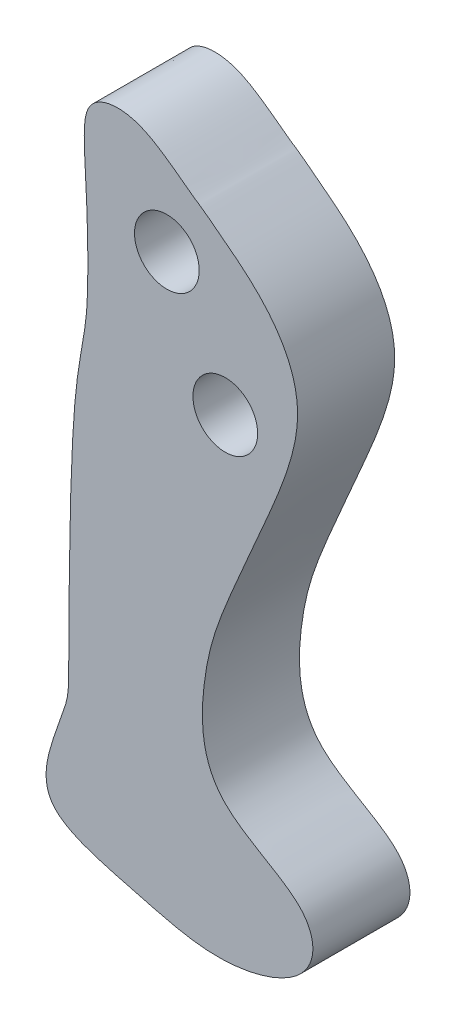
ISO-10303-21;
HEADER;
FILE_DESCRIPTION(('STEP AP214'),'2;1');
FILE_NAME('part.step','',(''),(''),'','','');
FILE_SCHEMA(('AUTOMOTIVE_DESIGN { 1 0 10303 214 1 1 1 1 }'));
ENDSEC;
DATA;
#1=APPLICATION_CONTEXT('core data for automotive mechanical design processes');
#2=APPLICATION_PROTOCOL_DEFINITION('international standard','automotive_design',2000,#1);
#3=PRODUCT_CONTEXT('',#1,'mechanical');
#4=PRODUCT('Part','Part','',(#3));
#5=PRODUCT_RELATED_PRODUCT_CATEGORY('part','',(#4));
#6=PRODUCT_DEFINITION_FORMATION('','',#4);
#7=PRODUCT_DEFINITION_CONTEXT('part definition',#1,'design');
#8=PRODUCT_DEFINITION('design','',#6,#7);
#9=PRODUCT_DEFINITION_SHAPE('','',#8);
#10=(LENGTH_UNIT() NAMED_UNIT(*) SI_UNIT(.MILLI.,.METRE.));
#11=(NAMED_UNIT(*) PLANE_ANGLE_UNIT() SI_UNIT($,.RADIAN.));
#12=(NAMED_UNIT(*) SI_UNIT($,.STERADIAN.) SOLID_ANGLE_UNIT());
#13=UNCERTAINTY_MEASURE_WITH_UNIT(LENGTH_MEASURE(1.E-05),#10,'distance_accuracy_value','');
#14=(GEOMETRIC_REPRESENTATION_CONTEXT(3) GLOBAL_UNCERTAINTY_ASSIGNED_CONTEXT((#13)) GLOBAL_UNIT_ASSIGNED_CONTEXT((#10,
#11,#12)) REPRESENTATION_CONTEXT('',''));
#15=CARTESIAN_POINT('',(0.,0.,0.));
#16=DIRECTION('',(0.,0.,1.));
#17=DIRECTION('',(1.,0.,0.));
#18=AXIS2_PLACEMENT_3D('',#15,#16,#17);
#19=CARTESIAN_POINT('',(-13.1845472847277,-15.3841095609765,3.));
#20=DIRECTION('',(0.,0.,1.));
#21=DIRECTION('',(1.,0.,0.));
#22=AXIS2_PLACEMENT_3D('',#19,#20,#21);
#23=PLANE('',#22);
#24=CARTESIAN_POINT('',(-10.3833351935108,-10.3395834074497,3.));
#25=DIRECTION('',(0.,0.,1.));
#26=DIRECTION('',(1.,0.,0.));
#27=AXIS2_PLACEMENT_3D('',#24,#25,#26);
#28=CIRCLE('',#27,1.);
#29=CARTESIAN_POINT('',(-9.38333519351078,-10.3395834074497,3.));
#30=VERTEX_POINT('',#29);
#31=EDGE_CURVE('E46',#30,#30,#28,.T.);
#32=ORIENTED_EDGE('',*,*,#31,.F.);
#33=EDGE_LOOP('',(#32));
#34=FACE_BOUND('',#33,.T.);
#35=CARTESIAN_POINT('',(-9.39360979871516,-8.56612857483147,3.));
#36=CARTESIAN_POINT('',(-9.41380741315842,-8.55337732824913,3.));
#37=CARTESIAN_POINT('',(-9.54227252737413,-8.48546784191576,3.));
#38=CARTESIAN_POINT('',(-10.1912158843901,-7.95131643824844,3.));
#39=CARTESIAN_POINT('',(-11.5782930982977,-7.06626500300892,3.));
#40=CARTESIAN_POINT('',(-13.0907105863516,-7.46166531868253,3.));
#41=CARTESIAN_POINT('',(-12.8556457271258,-9.42316781868157,3.));
#42=CARTESIAN_POINT('',(-12.7904005567067,-12.7268033420212,3.));
#43=CARTESIAN_POINT('',(-13.0851185161816,-14.8929948012885,3.));
#44=CARTESIAN_POINT('',(-13.3565544211728,-15.3931149717426,3.));
#45=CARTESIAN_POINT('',(-13.4331038960422,-24.3495149363567,3.));
#46=CARTESIAN_POINT('',(-13.3788128851339,-23.3966404972414,3.));
#47=CARTESIAN_POINT('',(-14.5340108775072,-27.1837066079103,3.));
#48=CARTESIAN_POINT('',(-11.5999987537417,-27.8782198678033,3.));
#49=CARTESIAN_POINT('',(-8.68689332185597,-28.6904040766711,3.));
#50=CARTESIAN_POINT('',(-5.74541024340899,-27.8474865851913,3.));
#51=CARTESIAN_POINT('',(-5.75182178056904,-25.6042031934017,3.));
#52=CARTESIAN_POINT('',(-9.36363622833601,-24.3527039618725,3.));
#53=CARTESIAN_POINT('',(-9.31674184553532,-20.935694707783,3.));
#54=CARTESIAN_POINT('',(-8.60446330672452,-18.8884135834449,3.));
#55=CARTESIAN_POINT('',(-7.49735320283347,-16.4437243251549,3.));
#56=CARTESIAN_POINT('',(-5.563524673518,-11.8250538557726,3.));
#57=CARTESIAN_POINT('',(-7.7637675585849,-9.80616179977347,3.));
#58=CARTESIAN_POINT('',(-9.08279454700842,-8.7867924885346,3.));
#59=CARTESIAN_POINT('',(-9.3146129836776,-8.61600119075809,3.));
#60=CARTESIAN_POINT('',(-9.39360979871516,-8.56612857483147,3.));
#61=B_SPLINE_CURVE_WITH_KNOTS('',3,(#35,#36,#37,#38,#39,#40,#41,#42,#43,#44,#45,#46,#47,#48,#49,
#50,#51,#52,#53,#54,#55,#56,#57,#58,#59,#60),.UNSPECIFIED.,.T.,.F.,(4,1,1,1,1,1,1,1,1,1,1,1,1,1,
1,1,1,1,1,1,1,1,1,4),(0.,0.0130136754142223,0.130136754142223,0.22656936505319,
0.294225093311794,0.365532257153247,0.422442783574096,0.442676854797588,0.56787296938817,
0.588768463598825,0.646377319051754,0.665686605833031,0.687025870582193,0.702445577383673,
0.726593262417666,0.747759969633077,0.771691535212956,0.797479422474093,0.828279171219995,
0.864003704392301,0.892675999463093,0.938368573601202,0.949100973654893,0.999999999999997),.UNSPECIFIED.);
#62=CARTESIAN_POINT('',(-9.39360979871516,-8.56612857483147,3.));
#63=VERTEX_POINT('',#62);
#64=EDGE_CURVE('E10',#63,#63,#61,.T.);
#65=ORIENTED_EDGE('',*,*,#64,.T.);
#66=EDGE_LOOP('',(#65));
#67=FACE_BOUND('',#66,.T.);
#68=CARTESIAN_POINT('',(-8.57781920583137,-13.8009889049657,3.));
#69=DIRECTION('',(0.,0.,1.));
#70=DIRECTION('',(1.,0.,0.));
#71=AXIS2_PLACEMENT_3D('',#68,#69,#70);
#72=CIRCLE('',#71,1.);
#73=CARTESIAN_POINT('',(-7.57781920583137,-13.8009889049657,3.));
#74=VERTEX_POINT('',#73);
#75=EDGE_CURVE('E57',#74,#74,#72,.T.);
#76=ORIENTED_EDGE('',*,*,#75,.F.);
#77=EDGE_LOOP('',(#76));
#78=FACE_BOUND('',#77,.T.);
#79=ADVANCED_FACE('F33',(#34,#67,#78),#23,.T.);
#80=CARTESIAN_POINT('',(-13.1845472847277,-15.3841095609765,0.));
#81=DIRECTION('',(0.,0.,1.));
#82=DIRECTION('',(1.,0.,0.));
#83=AXIS2_PLACEMENT_3D('',#80,#81,#82);
#84=PLANE('',#83);
#85=CARTESIAN_POINT('',(-9.39360979871516,-8.56612857483147,0.));
#86=CARTESIAN_POINT('',(-9.41380741315842,-8.55337732824913,0.));
#87=CARTESIAN_POINT('',(-9.54227252737413,-8.48546784191576,0.));
#88=CARTESIAN_POINT('',(-10.1912158843901,-7.95131643824844,0.));
#89=CARTESIAN_POINT('',(-11.5782930982977,-7.06626500300892,0.));
#90=CARTESIAN_POINT('',(-13.0907105863516,-7.46166531868253,0.));
#91=CARTESIAN_POINT('',(-12.8556457271258,-9.42316781868157,0.));
#92=CARTESIAN_POINT('',(-12.7904005567067,-12.7268033420212,0.));
#93=CARTESIAN_POINT('',(-13.0851185161816,-14.8929948012885,0.));
#94=CARTESIAN_POINT('',(-13.3565544211728,-15.3931149717426,0.));
#95=CARTESIAN_POINT('',(-13.4331038960422,-24.3495149363567,0.));
#96=CARTESIAN_POINT('',(-13.3788128851339,-23.3966404972414,0.));
#97=CARTESIAN_POINT('',(-14.5340108775072,-27.1837066079103,0.));
#98=CARTESIAN_POINT('',(-11.5999987537417,-27.8782198678033,0.));
#99=CARTESIAN_POINT('',(-8.68689332185597,-28.6904040766711,0.));
#100=CARTESIAN_POINT('',(-5.74541024340899,-27.8474865851913,0.));
#101=CARTESIAN_POINT('',(-5.75182178056904,-25.6042031934017,0.));
#102=CARTESIAN_POINT('',(-9.36363622833601,-24.3527039618725,0.));
#103=CARTESIAN_POINT('',(-9.31674184553532,-20.935694707783,0.));
#104=CARTESIAN_POINT('',(-8.60446330672452,-18.8884135834449,0.));
#105=CARTESIAN_POINT('',(-7.49735320283347,-16.4437243251549,0.));
#106=CARTESIAN_POINT('',(-5.563524673518,-11.8250538557726,0.));
#107=CARTESIAN_POINT('',(-7.7637675585849,-9.80616179977347,0.));
#108=CARTESIAN_POINT('',(-9.08279454700842,-8.7867924885346,0.));
#109=CARTESIAN_POINT('',(-9.3146129836776,-8.61600119075809,0.));
#110=CARTESIAN_POINT('',(-9.39360979871516,-8.56612857483147,0.));
#111=B_SPLINE_CURVE_WITH_KNOTS('',3,(#85,#86,#87,#88,#89,#90,#91,#92,#93,#94,#95,#96,#97,#98,
#99,#100,#101,#102,#103,#104,#105,#106,#107,#108,#109,#110),.UNSPECIFIED.,.T.,.F.,(4,1,1,1,1,1,
1,1,1,1,1,1,1,1,1,1,1,1,1,1,1,1,1,4),(0.,0.0130136754142223,0.130136754142223,0.22656936505319,
0.294225093311794,0.365532257153247,0.422442783574096,0.442676854797588,0.56787296938817,
0.588768463598825,0.646377319051754,0.665686605833031,0.687025870582193,0.702445577383673,
0.726593262417666,0.747759969633077,0.771691535212956,0.797479422474093,0.828279171219995,
0.864003704392301,0.892675999463093,0.938368573601202,0.949100973654893,0.999999999999997),.UNSPECIFIED.);
#112=CARTESIAN_POINT('',(-9.39360979871516,-8.56612857483147,0.));
#113=VERTEX_POINT('',#112);
#114=EDGE_CURVE('E38',#113,#113,#111,.T.);
#115=ORIENTED_EDGE('',*,*,#114,.F.);
#116=EDGE_LOOP('',(#115));
#117=FACE_BOUND('',#116,.T.);
#118=CARTESIAN_POINT('',(-10.3833351935108,-10.3395834074497,0.));
#119=DIRECTION('',(0.,0.,1.));
#120=DIRECTION('',(1.,0.,0.));
#121=AXIS2_PLACEMENT_3D('',#118,#119,#120);
#122=CIRCLE('',#121,1.);
#123=CARTESIAN_POINT('',(-9.38333519351078,-10.3395834074497,0.));
#124=VERTEX_POINT('',#123);
#125=EDGE_CURVE('E51',#124,#124,#122,.T.);
#126=ORIENTED_EDGE('',*,*,#125,.T.);
#127=EDGE_LOOP('',(#126));
#128=FACE_BOUND('',#127,.T.);
#129=CARTESIAN_POINT('',(-8.57781920583137,-13.8009889049657,0.));
#130=DIRECTION('',(0.,0.,1.));
#131=DIRECTION('',(1.,0.,0.));
#132=AXIS2_PLACEMENT_3D('',#129,#130,#131);
#133=CIRCLE('',#132,1.);
#134=CARTESIAN_POINT('',(-7.57781920583137,-13.8009889049657,0.));
#135=VERTEX_POINT('',#134);
#136=EDGE_CURVE('E60',#135,#135,#133,.T.);
#137=ORIENTED_EDGE('',*,*,#136,.T.);
#138=EDGE_LOOP('',(#137));
#139=FACE_BOUND('',#138,.T.);
#140=ADVANCED_FACE('F70',(#117,#128,#139),#84,.F.);
#141=DIRECTION('',(0.,0.,-1.));
#142=VECTOR('',#141,1.);
#143=SURFACE_OF_LINEAR_EXTRUSION('',#61,#142);
#144=ORIENTED_EDGE('',*,*,#64,.F.);
#145=EDGE_LOOP('',(#144));
#146=FACE_BOUND('',#145,.T.);
#147=ORIENTED_EDGE('',*,*,#114,.T.);
#148=EDGE_LOOP('',(#147));
#149=FACE_BOUND('',#148,.T.);
#150=ADVANCED_FACE('F35',(#146,#149),#143,.F.);
#151=CARTESIAN_POINT('',(-10.3833351935108,-10.3395834074497,3.));
#152=DIRECTION('',(0.,0.,-1.));
#153=DIRECTION('',(-1.,0.,0.));
#154=AXIS2_PLACEMENT_3D('',#151,#152,#153);
#155=CYLINDRICAL_SURFACE('',#154,1.);
#156=ORIENTED_EDGE('',*,*,#31,.T.);
#157=EDGE_LOOP('',(#156));
#158=FACE_BOUND('',#157,.T.);
#159=ORIENTED_EDGE('',*,*,#125,.F.);
#160=EDGE_LOOP('',(#159));
#161=FACE_BOUND('',#160,.T.);
#162=ADVANCED_FACE('F79',(#158,#161),#155,.F.);
#163=CARTESIAN_POINT('',(-8.57781920583137,-13.8009889049657,3.));
#164=DIRECTION('',(0.,0.,-1.));
#165=DIRECTION('',(-1.,0.,0.));
#166=AXIS2_PLACEMENT_3D('',#163,#164,#165);
#167=CYLINDRICAL_SURFACE('',#166,1.);
#168=ORIENTED_EDGE('',*,*,#75,.T.);
#169=EDGE_LOOP('',(#168));
#170=FACE_BOUND('',#169,.T.);
#171=ORIENTED_EDGE('',*,*,#136,.F.);
#172=EDGE_LOOP('',(#171));
#173=FACE_BOUND('',#172,.T.);
#174=ADVANCED_FACE('F66',(#170,#173),#167,.F.);
#175=CLOSED_SHELL('',(#79,#140,#150,#162,#174));
#176=MANIFOLD_SOLID_BREP('B2',#175);
#177=ADVANCED_BREP_SHAPE_REPRESENTATION('',(#18,#176),#14);
#178=SHAPE_DEFINITION_REPRESENTATION(#9,#177);
ENDSEC;
END-ISO-10303-21;
